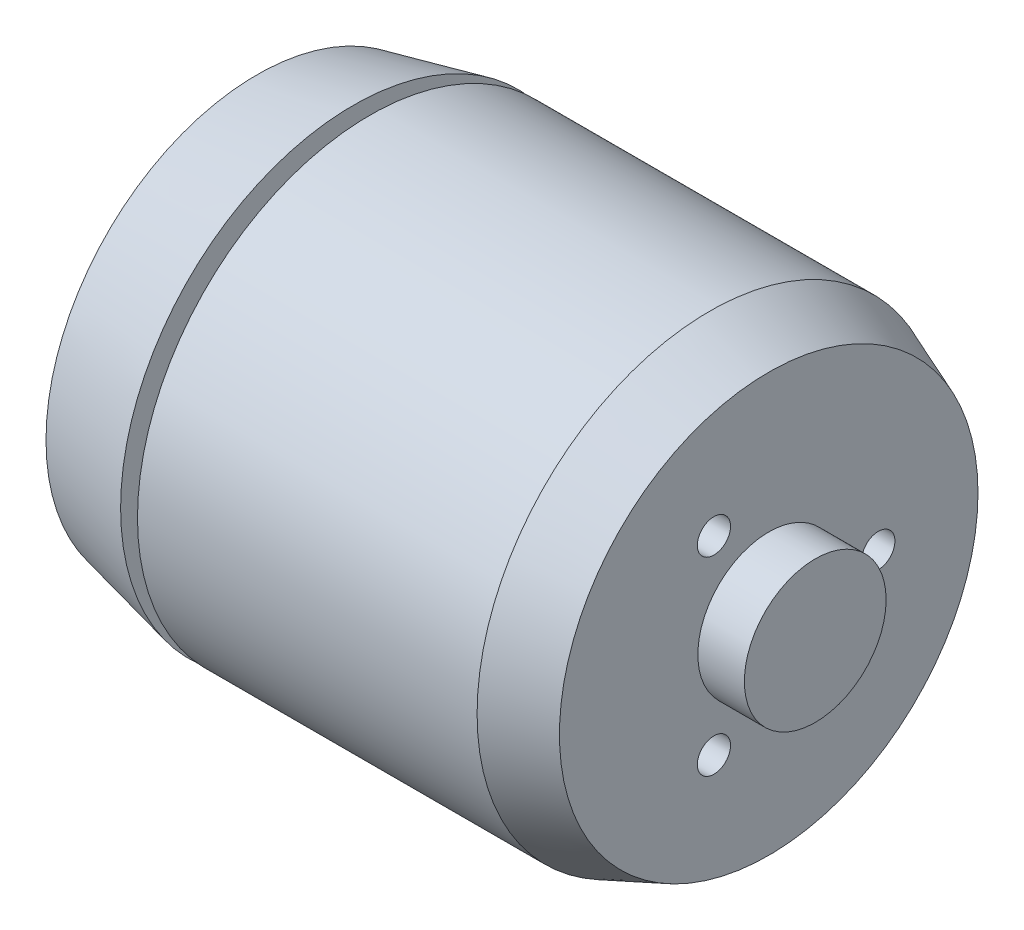
ISO-10303-21;
HEADER;
FILE_DESCRIPTION(('STEP AP214'),'2;1');
FILE_NAME('part.step','',(''),(''),'','','');
FILE_SCHEMA(('AUTOMOTIVE_DESIGN { 1 0 10303 214 1 1 1 1 }'));
ENDSEC;
DATA;
#1=APPLICATION_CONTEXT('core data for automotive mechanical design processes');
#2=APPLICATION_PROTOCOL_DEFINITION('international standard','automotive_design',2000,#1);
#3=PRODUCT_CONTEXT('',#1,'mechanical');
#4=PRODUCT('Part','Part','',(#3));
#5=PRODUCT_RELATED_PRODUCT_CATEGORY('part','',(#4));
#6=PRODUCT_DEFINITION_FORMATION('','',#4);
#7=PRODUCT_DEFINITION_CONTEXT('part definition',#1,'design');
#8=PRODUCT_DEFINITION('design','',#6,#7);
#9=PRODUCT_DEFINITION_SHAPE('','',#8);
#10=(LENGTH_UNIT() NAMED_UNIT(*) SI_UNIT(.MILLI.,.METRE.));
#11=(NAMED_UNIT(*) PLANE_ANGLE_UNIT() SI_UNIT($,.RADIAN.));
#12=(NAMED_UNIT(*) SI_UNIT($,.STERADIAN.) SOLID_ANGLE_UNIT());
#13=UNCERTAINTY_MEASURE_WITH_UNIT(LENGTH_MEASURE(1.E-05),#10,'distance_accuracy_value','');
#14=(GEOMETRIC_REPRESENTATION_CONTEXT(3) GLOBAL_UNCERTAINTY_ASSIGNED_CONTEXT((#13)) GLOBAL_UNIT_ASSIGNED_CONTEXT((#10,
#11,#12)) REPRESENTATION_CONTEXT('',''));
#15=CARTESIAN_POINT('',(0.,0.,0.));
#16=DIRECTION('',(0.,0.,1.));
#17=DIRECTION('',(1.,0.,0.));
#18=AXIS2_PLACEMENT_3D('',#15,#16,#17);
#19=CARTESIAN_POINT('',(-6.,0.,0.));
#20=DIRECTION('',(0.,0.,-1.));
#21=DIRECTION('',(0.,-1.,0.));
#22=AXIS2_PLACEMENT_3D('',#19,#20,#21);
#23=PLANE('',#22);
#24=DIRECTION('',(0.,1.,0.));
#25=VECTOR('',#24,1.);
#26=CARTESIAN_POINT('',(0.9854,-5.08,0.));
#27=LINE('',#26,#25);
#28=CARTESIAN_POINT('',(0.9854,-5.08,0.));
#29=VERTEX_POINT('',#28);
#30=CARTESIAN_POINT('',(0.9854,5.08,0.));
#31=VERTEX_POINT('',#30);
#32=EDGE_CURVE('E276',#29,#31,#27,.T.);
#33=ORIENTED_EDGE('',*,*,#32,.F.);
#34=DIRECTION('',(1.,0.,0.));
#35=VECTOR('',#34,1.);
#36=CARTESIAN_POINT('',(-3.7644,-5.08,0.));
#37=LINE('',#36,#35);
#38=CARTESIAN_POINT('',(-3.7644,-5.08,0.));
#39=VERTEX_POINT('',#38);
#40=EDGE_CURVE('E248',#39,#29,#37,.T.);
#41=ORIENTED_EDGE('',*,*,#40,.F.);
#42=DIRECTION('',(0.,-1.,0.));
#43=VECTOR('',#42,1.);
#44=CARTESIAN_POINT('',(-3.7644,-5.08,0.));
#45=LINE('',#44,#43);
#46=CARTESIAN_POINT('',(-3.7644,5.08,0.));
#47=VERTEX_POINT('',#46);
#48=EDGE_CURVE('E10',#47,#39,#45,.T.);
#49=ORIENTED_EDGE('',*,*,#48,.F.);
#50=DIRECTION('',(-1.,0.,0.));
#51=VECTOR('',#50,1.);
#52=CARTESIAN_POINT('',(-3.7644,5.08,0.));
#53=LINE('',#52,#51);
#54=EDGE_CURVE('E308',#31,#47,#53,.T.);
#55=ORIENTED_EDGE('',*,*,#54,.F.);
#56=EDGE_LOOP('',(#33,#41,#49,#55));
#57=FACE_BOUND('',#56,.T.);
#58=ADVANCED_FACE('F16',(#57),#23,.T.);
#59=CARTESIAN_POINT('',(-3.7644,-5.08,-17.5));
#60=DIRECTION('',(-1.,0.,0.));
#61=DIRECTION('',(0.,0.,1.));
#62=AXIS2_PLACEMENT_3D('',#59,#60,#61);
#63=PLANE('',#62);
#64=CARTESIAN_POINT('',(-3.7644,0.,-11.0612));
#65=DIRECTION('',(1.,0.,0.));
#66=DIRECTION('',(0.,0.,1.));
#67=AXIS2_PLACEMENT_3D('',#64,#65,#66);
#68=CIRCLE('',#67,4.);
#69=CARTESIAN_POINT('',(-3.7644,0.,-15.0612));
#70=VERTEX_POINT('',#69);
#71=EDGE_CURVE('E343',#70,#70,#68,.T.);
#72=ORIENTED_EDGE('',*,*,#71,.F.);
#73=EDGE_LOOP('',(#72));
#74=FACE_BOUND('',#73,.T.);
#75=DIRECTION('',(0.,0.,1.));
#76=VECTOR('',#75,1.);
#77=CARTESIAN_POINT('',(-3.7644,5.08,-17.5));
#78=LINE('',#77,#76);
#79=CARTESIAN_POINT('',(-3.7644,5.08,-15.3348552618978));
#80=VERTEX_POINT('',#79);
#81=EDGE_CURVE('E20',#80,#47,#78,.T.);
#82=ORIENTED_EDGE('',*,*,#81,.T.);
#83=ORIENTED_EDGE('',*,*,#48,.T.);
#84=DIRECTION('',(0.,0.,1.));
#85=VECTOR('',#84,1.);
#86=CARTESIAN_POINT('',(-3.7644,-5.08,-17.5));
#87=LINE('',#86,#85);
#88=CARTESIAN_POINT('',(-3.7644,-5.08,-15.3348552618978));
#89=VERTEX_POINT('',#88);
#90=EDGE_CURVE('E244',#89,#39,#87,.T.);
#91=ORIENTED_EDGE('',*,*,#90,.F.);
#92=CARTESIAN_POINT('',(-3.7644,0.,0.));
#93=DIRECTION('',(-1.,0.,0.));
#94=DIRECTION('',(0.,0.,1.));
#95=AXIS2_PLACEMENT_3D('',#92,#93,#94);
#96=CIRCLE('',#95,16.1543859649123);
#97=EDGE_CURVE('E294',#80,#89,#96,.T.);
#98=ORIENTED_EDGE('',*,*,#97,.F.);
#99=EDGE_LOOP('',(#82,#83,#91,#98));
#100=FACE_BOUND('',#99,.T.);
#101=ADVANCED_FACE('F604',(#74,#100),#63,.F.);
#102=CARTESIAN_POINT('',(-3.7644,5.08,-17.5));
#103=DIRECTION('',(0.,1.,0.));
#104=DIRECTION('',(1.,0.,0.));
#105=AXIS2_PLACEMENT_3D('',#102,#103,#104);
#106=PLANE('',#105);
#107=DIRECTION('',(0.,0.,1.));
#108=VECTOR('',#107,1.);
#109=CARTESIAN_POINT('',(0.9854,5.08,-17.5));
#110=LINE('',#109,#108);
#111=CARTESIAN_POINT('',(0.9854,5.08,-16.4542744521131));
#112=VERTEX_POINT('',#111);
#113=EDGE_CURVE('E249',#112,#31,#110,.T.);
#114=ORIENTED_EDGE('',*,*,#113,.T.);
#115=ORIENTED_EDGE('',*,*,#54,.T.);
#116=ORIENTED_EDGE('',*,*,#81,.F.);
#117=CARTESIAN_POINT('',(0.9854,5.08,-16.4542744521131));
#118=CARTESIAN_POINT('',(-0.598129142286878,5.08,-16.0822506345086));
#119=CARTESIAN_POINT('',(-2.18141487248692,5.08,-15.7091919528578));
#120=CARTESIAN_POINT('',(-3.7644,5.08,-15.3348552618978));
#121=(BOUNDED_CURVE() B_SPLINE_CURVE(3,(#117,#118,#119,#120),.UNSPECIFIED.,.F.,
.F.) B_SPLINE_CURVE_WITH_KNOTS((4,4),(0.0186183002080263,0.0234982279464003),
.UNSPECIFIED.) CURVE() GEOMETRIC_REPRESENTATION_ITEM() RATIONAL_B_SPLINE_CURVE((1.,1.,1.,1.)) REPRESENTATION_ITEM(''));
#122=EDGE_CURVE('E265',#112,#80,#121,.T.);
#123=ORIENTED_EDGE('',*,*,#122,.F.);
#124=EDGE_LOOP('',(#114,#115,#116,#123));
#125=FACE_BOUND('',#124,.T.);
#126=ADVANCED_FACE('F609',(#125),#106,.F.);
#127=CARTESIAN_POINT('',(-3.7644,-5.08,-17.5));
#128=DIRECTION('',(0.,-1.,0.));
#129=DIRECTION('',(0.,0.,-1.));
#130=AXIS2_PLACEMENT_3D('',#127,#128,#129);
#131=PLANE('',#130);
#132=ORIENTED_EDGE('',*,*,#90,.T.);
#133=ORIENTED_EDGE('',*,*,#40,.T.);
#134=DIRECTION('',(0.,0.,1.));
#135=VECTOR('',#134,1.);
#136=CARTESIAN_POINT('',(0.9854,-5.08,-17.5));
#137=LINE('',#136,#135);
#138=CARTESIAN_POINT('',(0.9854,-5.08,-16.4542744521131));
#139=VERTEX_POINT('',#138);
#140=EDGE_CURVE('E272',#139,#29,#137,.T.);
#141=ORIENTED_EDGE('',*,*,#140,.F.);
#142=CARTESIAN_POINT('',(-3.7644,-5.08,-15.3348552618978));
#143=CARTESIAN_POINT('',(-2.18141642114675,-5.08,-15.7091915866381));
#144=CARTESIAN_POINT('',(-0.59812759620077,-5.08,-16.0822509977358));
#145=CARTESIAN_POINT('',(0.9854,-5.08,-16.4542744521131));
#146=(BOUNDED_CURVE() B_SPLINE_CURVE(3,(#142,#143,#144,#145),.UNSPECIFIED.,.F.,
.F.) B_SPLINE_CURVE_WITH_KNOTS((4,4),(0.0186526350852368,0.0235325216490011),
.UNSPECIFIED.) CURVE() GEOMETRIC_REPRESENTATION_ITEM() RATIONAL_B_SPLINE_CURVE((1.,1.,1.,1.)) REPRESENTATION_ITEM(''));
#147=EDGE_CURVE('E266',#89,#139,#146,.T.);
#148=ORIENTED_EDGE('',*,*,#147,.F.);
#149=EDGE_LOOP('',(#132,#133,#141,#148));
#150=FACE_BOUND('',#149,.T.);
#151=ADVANCED_FACE('F666',(#150),#131,.F.);
#152=CARTESIAN_POINT('',(0.9854,-5.08,-17.5));
#153=DIRECTION('',(1.,0.,0.));
#154=DIRECTION('',(0.,0.,1.));
#155=AXIS2_PLACEMENT_3D('',#152,#153,#154);
#156=PLANE('',#155);
#157=ORIENTED_EDGE('',*,*,#140,.T.);
#158=ORIENTED_EDGE('',*,*,#32,.T.);
#159=ORIENTED_EDGE('',*,*,#113,.F.);
#160=CARTESIAN_POINT('',(0.9854,0.,0.));
#161=DIRECTION('',(1.,0.,0.));
#162=DIRECTION('',(0.,0.,-1.));
#163=AXIS2_PLACEMENT_3D('',#160,#161,#162);
#164=CIRCLE('',#163,17.2206140350877);
#165=EDGE_CURVE('E261',#139,#112,#164,.T.);
#166=ORIENTED_EDGE('',*,*,#165,.F.);
#167=EDGE_LOOP('',(#157,#158,#159,#166));
#168=FACE_BOUND('',#167,.T.);
#169=ADVANCED_FACE('F671',(#168),#156,.F.);
#170=CARTESIAN_POINT('',(-0.564000000000009,-11.0612,0.));
#171=DIRECTION('',(-1.,0.,0.));
#172=DIRECTION('',(0.,0.,1.));
#173=AXIS2_PLACEMENT_3D('',#170,#171,#172);
#174=PLANE('',#173);
#175=CARTESIAN_POINT('',(-0.564000000000009,-11.0612,0.));
#176=DIRECTION('',(-1.,0.,0.));
#177=DIRECTION('',(0.,0.,1.));
#178=AXIS2_PLACEMENT_3D('',#175,#176,#177);
#179=CIRCLE('',#178,4.);
#180=CARTESIAN_POINT('',(-0.564000000000008,-11.0612,-4.));
#181=VERTEX_POINT('',#180);
#182=EDGE_CURVE('E236',#181,#181,#179,.T.);
#183=ORIENTED_EDGE('',*,*,#182,.T.);
#184=EDGE_LOOP('',(#183));
#185=FACE_BOUND('',#184,.T.);
#186=ADVANCED_FACE('F535',(#185),#174,.T.);
#187=CARTESIAN_POINT('',(-0.564000000000007,-6.71751442127222,-6.71751442127219));
#188=DIRECTION('',(-1.,0.,0.));
#189=DIRECTION('',(0.,0.,1.));
#190=AXIS2_PLACEMENT_3D('',#187,#188,#189);
#191=PLANE('',#190);
#192=CARTESIAN_POINT('',(-0.564000000000007,-6.71751442127222,-6.71751442127219));
#193=DIRECTION('',(-1.,0.,0.));
#194=DIRECTION('',(0.,0.,1.));
#195=AXIS2_PLACEMENT_3D('',#192,#193,#194);
#196=CIRCLE('',#195,1.5);
#197=CARTESIAN_POINT('',(-0.564,-6.71751442127222,-8.21751442127219));
#198=VERTEX_POINT('',#197);
#199=EDGE_CURVE('E280',#198,#198,#196,.T.);
#200=ORIENTED_EDGE('',*,*,#199,.T.);
#201=EDGE_LOOP('',(#200));
#202=FACE_BOUND('',#201,.T.);
#203=ADVANCED_FACE('F529',(#202),#191,.T.);
#204=CARTESIAN_POINT('',(-0.564000000000007,8.83883476483182,-8.83883476483186));
#205=DIRECTION('',(-1.,0.,0.));
#206=DIRECTION('',(0.,0.,1.));
#207=AXIS2_PLACEMENT_3D('',#204,#205,#206);
#208=PLANE('',#207);
#209=CARTESIAN_POINT('',(-0.564000000000007,8.83883476483182,-8.83883476483186));
#210=DIRECTION('',(-1.,0.,0.));
#211=DIRECTION('',(0.,0.,1.));
#212=AXIS2_PLACEMENT_3D('',#209,#210,#211);
#213=CIRCLE('',#212,1.5);
#214=CARTESIAN_POINT('',(-0.564,8.83883476483182,-10.3388347648319));
#215=VERTEX_POINT('',#214);
#216=EDGE_CURVE('E301',#215,#215,#213,.T.);
#217=ORIENTED_EDGE('',*,*,#216,.T.);
#218=EDGE_LOOP('',(#217));
#219=FACE_BOUND('',#218,.T.);
#220=ADVANCED_FACE('F534',(#219),#208,.T.);
#221=CARTESIAN_POINT('',(-0.564000000000011,-8.83883476483183,8.83883476483186));
#222=DIRECTION('',(-1.,0.,0.));
#223=DIRECTION('',(0.,0.,1.));
#224=AXIS2_PLACEMENT_3D('',#221,#222,#223);
#225=PLANE('',#224);
#226=CARTESIAN_POINT('',(-0.564000000000011,-8.83883476483183,8.83883476483186));
#227=DIRECTION('',(-1.,0.,0.));
#228=DIRECTION('',(0.,0.,1.));
#229=AXIS2_PLACEMENT_3D('',#226,#227,#228);
#230=CIRCLE('',#229,1.5);
#231=CARTESIAN_POINT('',(-0.564000000000011,-8.83883476483183,7.33883476483186));
#232=VERTEX_POINT('',#231);
#233=EDGE_CURVE('E322',#232,#232,#230,.T.);
#234=ORIENTED_EDGE('',*,*,#233,.T.);
#235=EDGE_LOOP('',(#234));
#236=FACE_BOUND('',#235,.T.);
#237=ADVANCED_FACE('F433',(#236),#225,.T.);
#238=CARTESIAN_POINT('',(-0.564000000000009,11.0612,0.));
#239=DIRECTION('',(-1.,0.,0.));
#240=DIRECTION('',(0.,0.,1.));
#241=AXIS2_PLACEMENT_3D('',#238,#239,#240);
#242=PLANE('',#241);
#243=CARTESIAN_POINT('',(-0.564000000000009,11.0612,0.));
#244=DIRECTION('',(-1.,0.,0.));
#245=DIRECTION('',(0.,0.,1.));
#246=AXIS2_PLACEMENT_3D('',#243,#244,#245);
#247=CIRCLE('',#246,4.);
#248=CARTESIAN_POINT('',(-0.564000000000008,11.0612,-4.));
#249=VERTEX_POINT('',#248);
#250=EDGE_CURVE('E222',#249,#249,#247,.T.);
#251=ORIENTED_EDGE('',*,*,#250,.T.);
#252=EDGE_LOOP('',(#251));
#253=FACE_BOUND('',#252,.T.);
#254=ADVANCED_FACE('F597',(#253),#242,.T.);
#255=CARTESIAN_POINT('',(-0.564000000000013,0.,11.0612));
#256=DIRECTION('',(-1.,0.,0.));
#257=DIRECTION('',(0.,0.,1.));
#258=AXIS2_PLACEMENT_3D('',#255,#256,#257);
#259=PLANE('',#258);
#260=CARTESIAN_POINT('',(-0.564000000000013,0.,11.0612));
#261=DIRECTION('',(-1.,0.,0.));
#262=DIRECTION('',(0.,0.,1.));
#263=AXIS2_PLACEMENT_3D('',#260,#261,#262);
#264=CIRCLE('',#263,4.);
#265=CARTESIAN_POINT('',(-0.564000000000012,0.,7.0612));
#266=VERTEX_POINT('',#265);
#267=EDGE_CURVE('E202',#266,#266,#264,.T.);
#268=ORIENTED_EDGE('',*,*,#267,.T.);
#269=EDGE_LOOP('',(#268));
#270=FACE_BOUND('',#269,.T.);
#271=ADVANCED_FACE('F208',(#270),#259,.T.);
#272=CARTESIAN_POINT('',(-0.564000000000011,6.71751442127222,6.71751442127219));
#273=DIRECTION('',(-1.,0.,0.));
#274=DIRECTION('',(0.,0.,1.));
#275=AXIS2_PLACEMENT_3D('',#272,#273,#274);
#276=PLANE('',#275);
#277=CARTESIAN_POINT('',(-0.564000000000011,6.71751442127222,6.71751442127219));
#278=DIRECTION('',(-1.,0.,0.));
#279=DIRECTION('',(0.,0.,1.));
#280=AXIS2_PLACEMENT_3D('',#277,#278,#279);
#281=CIRCLE('',#280,1.5);
#282=CARTESIAN_POINT('',(-0.564000000000011,6.71751442127222,5.21751442127219));
#283=VERTEX_POINT('',#282);
#284=EDGE_CURVE('E312',#283,#283,#281,.T.);
#285=ORIENTED_EDGE('',*,*,#284,.T.);
#286=EDGE_LOOP('',(#285));
#287=FACE_BOUND('',#286,.T.);
#288=ADVANCED_FACE('F507',(#287),#276,.T.);
#289=CARTESIAN_POINT('',(2.23,0.,-12.5));
#290=DIRECTION('',(-1.,0.,0.));
#291=DIRECTION('',(0.,0.,1.));
#292=AXIS2_PLACEMENT_3D('',#289,#290,#291);
#293=PLANE('',#292);
#294=CARTESIAN_POINT('',(2.23,0.,0.));
#295=DIRECTION('',(-1.,0.,0.));
#296=DIRECTION('',(0.,0.,1.));
#297=AXIS2_PLACEMENT_3D('',#294,#295,#296);
#298=CIRCLE('',#297,12.5);
#299=CARTESIAN_POINT('',(2.23,0.,-12.5));
#300=VERTEX_POINT('',#299);
#301=EDGE_CURVE('E270',#300,#300,#298,.T.);
#302=ORIENTED_EDGE('',*,*,#301,.T.);
#303=EDGE_LOOP('',(#302));
#304=FACE_BOUND('',#303,.T.);
#305=CARTESIAN_POINT('',(2.23,0.,0.));
#306=DIRECTION('',(-1.,0.,0.));
#307=DIRECTION('',(0.,0.,1.));
#308=AXIS2_PLACEMENT_3D('',#305,#306,#307);
#309=CIRCLE('',#308,17.5);
#310=CARTESIAN_POINT('',(2.23,0.,17.5));
#311=VERTEX_POINT('',#310);
#312=EDGE_CURVE('E305',#311,#311,#309,.T.);
#313=ORIENTED_EDGE('',*,*,#312,.F.);
#314=EDGE_LOOP('',(#313));
#315=FACE_BOUND('',#314,.T.);
#316=ADVANCED_FACE('F501',(#304,#315),#293,.F.);
#317=CARTESIAN_POINT('',(-5.009,0.,-15.875));
#318=DIRECTION('',(1.,0.,0.));
#319=DIRECTION('',(0.,0.,1.));
#320=AXIS2_PLACEMENT_3D('',#317,#318,#319);
#321=PLANE('',#320);
#322=CARTESIAN_POINT('',(-5.009,0.,0.));
#323=DIRECTION('',(-1.,0.,0.));
#324=DIRECTION('',(0.,0.,1.));
#325=AXIS2_PLACEMENT_3D('',#322,#323,#324);
#326=CIRCLE('',#325,2.5);
#327=CARTESIAN_POINT('',(-5.009,0.,-2.5));
#328=VERTEX_POINT('',#327);
#329=EDGE_CURVE('E242',#328,#328,#326,.T.);
#330=ORIENTED_EDGE('',*,*,#329,.F.);
#331=EDGE_LOOP('',(#330));
#332=FACE_BOUND('',#331,.T.);
#333=CARTESIAN_POINT('',(-5.009,6.71751442127222,6.71751442127219));
#334=DIRECTION('',(-1.,0.,0.));
#335=DIRECTION('',(0.,0.,1.));
#336=AXIS2_PLACEMENT_3D('',#333,#334,#335);
#337=CIRCLE('',#336,1.5);
#338=CARTESIAN_POINT('',(-5.009,6.71751442127222,5.21751442127219));
#339=VERTEX_POINT('',#338);
#340=EDGE_CURVE('E267',#339,#339,#337,.T.);
#341=ORIENTED_EDGE('',*,*,#340,.F.);
#342=EDGE_LOOP('',(#341));
#343=FACE_BOUND('',#342,.T.);
#344=CARTESIAN_POINT('',(-5.009,0.,11.0612));
#345=DIRECTION('',(-1.,0.,0.));
#346=DIRECTION('',(0.,0.,1.));
#347=AXIS2_PLACEMENT_3D('',#344,#345,#346);
#348=CIRCLE('',#347,4.);
#349=CARTESIAN_POINT('',(-5.009,0.,7.0612));
#350=VERTEX_POINT('',#349);
#351=EDGE_CURVE('E204',#350,#350,#348,.T.);
#352=ORIENTED_EDGE('',*,*,#351,.F.);
#353=EDGE_LOOP('',(#352));
#354=FACE_BOUND('',#353,.T.);
#355=CARTESIAN_POINT('',(-5.009,11.0612,0.));
#356=DIRECTION('',(-1.,0.,0.));
#357=DIRECTION('',(0.,0.,1.));
#358=AXIS2_PLACEMENT_3D('',#355,#356,#357);
#359=CIRCLE('',#358,4.);
#360=CARTESIAN_POINT('',(-5.009,11.0612,-4.));
#361=VERTEX_POINT('',#360);
#362=EDGE_CURVE('E210',#361,#361,#359,.T.);
#363=ORIENTED_EDGE('',*,*,#362,.F.);
#364=EDGE_LOOP('',(#363));
#365=FACE_BOUND('',#364,.T.);
#366=CARTESIAN_POINT('',(-5.009,0.,-11.0612));
#367=DIRECTION('',(-1.,0.,0.));
#368=DIRECTION('',(0.,0.,1.));
#369=AXIS2_PLACEMENT_3D('',#366,#367,#368);
#370=CIRCLE('',#369,4.);
#371=CARTESIAN_POINT('',(-5.009,0.,-15.0612));
#372=VERTEX_POINT('',#371);
#373=EDGE_CURVE('E226',#372,#372,#370,.T.);
#374=ORIENTED_EDGE('',*,*,#373,.F.);
#375=EDGE_LOOP('',(#374));
#376=FACE_BOUND('',#375,.T.);
#377=CARTESIAN_POINT('',(-5.009,-8.83883476483183,8.83883476483186));
#378=DIRECTION('',(-1.,0.,0.));
#379=DIRECTION('',(0.,0.,1.));
#380=AXIS2_PLACEMENT_3D('',#377,#378,#379);
#381=CIRCLE('',#380,1.5);
#382=CARTESIAN_POINT('',(-5.009,-8.83883476483183,7.33883476483186));
#383=VERTEX_POINT('',#382);
#384=EDGE_CURVE('E220',#383,#383,#381,.T.);
#385=ORIENTED_EDGE('',*,*,#384,.F.);
#386=EDGE_LOOP('',(#385));
#387=FACE_BOUND('',#386,.T.);
#388=CARTESIAN_POINT('',(-5.009,8.83883476483182,-8.83883476483186));
#389=DIRECTION('',(-1.,0.,0.));
#390=DIRECTION('',(0.,0.,1.));
#391=AXIS2_PLACEMENT_3D('',#388,#389,#390);
#392=CIRCLE('',#391,1.5);
#393=CARTESIAN_POINT('',(-5.009,8.83883476483182,-10.3388347648319));
#394=VERTEX_POINT('',#393);
#395=EDGE_CURVE('E74',#394,#394,#392,.T.);
#396=ORIENTED_EDGE('',*,*,#395,.F.);
#397=EDGE_LOOP('',(#396));
#398=FACE_BOUND('',#397,.T.);
#399=CARTESIAN_POINT('',(-5.009,-6.71751442127222,-6.71751442127219));
#400=DIRECTION('',(-1.,0.,0.));
#401=DIRECTION('',(0.,0.,1.));
#402=AXIS2_PLACEMENT_3D('',#399,#400,#401);
#403=CIRCLE('',#402,1.5);
#404=CARTESIAN_POINT('',(-5.009,-6.71751442127222,-8.21751442127219));
#405=VERTEX_POINT('',#404);
#406=EDGE_CURVE('E295',#405,#405,#403,.T.);
#407=ORIENTED_EDGE('',*,*,#406,.F.);
#408=EDGE_LOOP('',(#407));
#409=FACE_BOUND('',#408,.T.);
#410=CARTESIAN_POINT('',(-5.009,-11.0612,0.));
#411=DIRECTION('',(-1.,0.,0.));
#412=DIRECTION('',(0.,0.,1.));
#413=AXIS2_PLACEMENT_3D('',#410,#411,#412);
#414=CIRCLE('',#413,4.);
#415=CARTESIAN_POINT('',(-5.009,-11.0612,-4.));
#416=VERTEX_POINT('',#415);
#417=EDGE_CURVE('E277',#416,#416,#414,.T.);
#418=ORIENTED_EDGE('',*,*,#417,.F.);
#419=EDGE_LOOP('',(#418));
#420=FACE_BOUND('',#419,.T.);
#421=CARTESIAN_POINT('',(-5.009,0.,0.));
#422=DIRECTION('',(-1.,0.,0.));
#423=DIRECTION('',(0.,0.,1.));
#424=AXIS2_PLACEMENT_3D('',#421,#422,#423);
#425=CIRCLE('',#424,15.875);
#426=CARTESIAN_POINT('',(-5.009,0.,15.875));
#427=VERTEX_POINT('',#426);
#428=EDGE_CURVE('E117',#427,#427,#425,.T.);
#429=ORIENTED_EDGE('',*,*,#428,.T.);
#430=EDGE_LOOP('',(#429));
#431=FACE_BOUND('',#430,.T.);
#432=ADVANCED_FACE('F506',(#332,#343,#354,#365,#376,#387,#398,#409,#420,#431),#321,.F.);
#433=CARTESIAN_POINT('',(-6.,0.,-2.5));
#434=DIRECTION('',(1.,0.,0.));
#435=DIRECTION('',(0.,0.,1.));
#436=AXIS2_PLACEMENT_3D('',#433,#434,#435);
#437=PLANE('',#436);
#438=CARTESIAN_POINT('',(-6.,0.,0.));
#439=DIRECTION('',(-1.,0.,0.));
#440=DIRECTION('',(0.,0.,1.));
#441=AXIS2_PLACEMENT_3D('',#438,#439,#440);
#442=CIRCLE('',#441,2.5);
#443=CARTESIAN_POINT('',(-6.,0.,-2.5));
#444=VERTEX_POINT('',#443);
#445=EDGE_CURVE('E243',#444,#444,#442,.T.);
#446=ORIENTED_EDGE('',*,*,#445,.T.);
#447=EDGE_LOOP('',(#446));
#448=FACE_BOUND('',#447,.T.);
#449=ADVANCED_FACE('F691',(#448),#437,.F.);
#450=CARTESIAN_POINT('',(-293.397520162874,0.,0.));
#451=DIRECTION('',(-1.,0.,0.));
#452=DIRECTION('',(0.,0.,1.));
#453=AXIS2_PLACEMENT_3D('',#450,#451,#452);
#454=CYLINDRICAL_SURFACE('',#453,2.5);
#455=ORIENTED_EDGE('',*,*,#445,.F.);
#456=DIRECTION('',(1.,0.,0.));
#457=VECTOR('',#456,1.);
#458=CARTESIAN_POINT('',(-293.397520162874,0.,-2.50000000000008));
#459=LINE('',#458,#457);
#460=EDGE_CURVE('E238',#444,#328,#459,.T.);
#461=ORIENTED_EDGE('',*,*,#460,.T.);
#462=ORIENTED_EDGE('',*,*,#329,.T.);
#463=ORIENTED_EDGE('',*,*,#460,.F.);
#464=EDGE_LOOP('',(#455,#461,#462,#463));
#465=FACE_BOUND('',#464,.T.);
#466=ADVANCED_FACE('F702',(#465),#454,.T.);
#467=CARTESIAN_POINT('',(2.23,0.,0.));
#468=DIRECTION('',(1.,0.,0.));
#469=DIRECTION('',(0.,0.,-1.));
#470=AXIS2_PLACEMENT_3D('',#467,#468,#469);
#471=CONICAL_SURFACE('',#470,17.5,0.220818033952911);
#472=ORIENTED_EDGE('',*,*,#97,.T.);
#473=ORIENTED_EDGE('',*,*,#147,.T.);
#474=ORIENTED_EDGE('',*,*,#165,.T.);
#475=ORIENTED_EDGE('',*,*,#122,.T.);
#476=EDGE_LOOP('',(#472,#473,#474,#475));
#477=FACE_BOUND('',#476,.T.);
#478=ORIENTED_EDGE('',*,*,#312,.T.);
#479=DIRECTION('',(-0.975718603584016,0.,-0.219027867222549));
#480=VECTOR('',#479,1.);
#481=CARTESIAN_POINT('',(2.23,0.,17.5));
#482=LINE('',#481,#480);
#483=EDGE_CURVE('E132',#311,#427,#482,.T.);
#484=ORIENTED_EDGE('',*,*,#483,.T.);
#485=ORIENTED_EDGE('',*,*,#428,.F.);
#486=ORIENTED_EDGE('',*,*,#483,.F.);
#487=EDGE_LOOP('',(#478,#484,#485,#486));
#488=FACE_BOUND('',#487,.T.);
#489=ADVANCED_FACE('F584',(#477,#488),#471,.T.);
#490=CARTESIAN_POINT('',(-293.397520162874,0.,0.));
#491=DIRECTION('',(-1.,0.,0.));
#492=DIRECTION('',(0.,0.,1.));
#493=AXIS2_PLACEMENT_3D('',#490,#491,#492);
#494=CYLINDRICAL_SURFACE('',#493,12.5);
#495=ORIENTED_EDGE('',*,*,#301,.F.);
#496=DIRECTION('',(1.,0.,0.));
#497=VECTOR('',#496,1.);
#498=CARTESIAN_POINT('',(-293.397520162874,0.,-12.5));
#499=LINE('',#498,#497);
#500=CARTESIAN_POINT('',(3.5,0.,-12.5));
#501=VERTEX_POINT('',#500);
#502=EDGE_CURVE('E288',#300,#501,#499,.T.);
#503=ORIENTED_EDGE('',*,*,#502,.T.);
#504=CARTESIAN_POINT('',(3.5,0.,0.));
#505=DIRECTION('',(-1.,0.,0.));
#506=DIRECTION('',(0.,0.,1.));
#507=AXIS2_PLACEMENT_3D('',#504,#505,#506);
#508=CIRCLE('',#507,12.5);
#509=EDGE_CURVE('E250',#501,#501,#508,.T.);
#510=ORIENTED_EDGE('',*,*,#509,.T.);
#511=ORIENTED_EDGE('',*,*,#502,.F.);
#512=EDGE_LOOP('',(#495,#503,#510,#511));
#513=FACE_BOUND('',#512,.T.);
#514=ADVANCED_FACE('F578',(#513),#494,.T.);
#515=CARTESIAN_POINT('',(-0.564000000000011,6.71751442127222,6.71751442127219));
#516=DIRECTION('',(-1.,0.,0.));
#517=DIRECTION('',(0.,0.,1.));
#518=AXIS2_PLACEMENT_3D('',#515,#516,#517);
#519=CYLINDRICAL_SURFACE('',#518,1.5);
#520=ORIENTED_EDGE('',*,*,#284,.F.);
#521=DIRECTION('',(-1.,0.,0.));
#522=VECTOR('',#521,1.);
#523=CARTESIAN_POINT('',(-0.564000000000011,6.71751442127222,5.21751442127219));
#524=LINE('',#523,#522);
#525=EDGE_CURVE('E271',#283,#339,#524,.T.);
#526=ORIENTED_EDGE('',*,*,#525,.T.);
#527=ORIENTED_EDGE('',*,*,#340,.T.);
#528=ORIENTED_EDGE('',*,*,#525,.F.);
#529=EDGE_LOOP('',(#520,#526,#527,#528));
#530=FACE_BOUND('',#529,.T.);
#531=ADVANCED_FACE('F583',(#530),#519,.F.);
#532=CARTESIAN_POINT('',(-0.564000000000013,0.,11.0612));
#533=DIRECTION('',(-1.,0.,0.));
#534=DIRECTION('',(0.,0.,1.));
#535=AXIS2_PLACEMENT_3D('',#532,#533,#534);
#536=CYLINDRICAL_SURFACE('',#535,4.);
#537=ORIENTED_EDGE('',*,*,#267,.F.);
#538=DIRECTION('',(-1.,0.,0.));
#539=VECTOR('',#538,1.);
#540=CARTESIAN_POINT('',(-0.564000000000012,0.,7.0612));
#541=LINE('',#540,#539);
#542=EDGE_CURVE('E200',#266,#350,#541,.T.);
#543=ORIENTED_EDGE('',*,*,#542,.T.);
#544=ORIENTED_EDGE('',*,*,#351,.T.);
#545=ORIENTED_EDGE('',*,*,#542,.F.);
#546=EDGE_LOOP('',(#537,#543,#544,#545));
#547=FACE_BOUND('',#546,.T.);
#548=ADVANCED_FACE('F18',(#547),#536,.F.);
#549=CARTESIAN_POINT('',(-0.564000000000009,11.0612,0.));
#550=DIRECTION('',(-1.,0.,0.));
#551=DIRECTION('',(0.,0.,1.));
#552=AXIS2_PLACEMENT_3D('',#549,#550,#551);
#553=CYLINDRICAL_SURFACE('',#552,4.);
#554=ORIENTED_EDGE('',*,*,#250,.F.);
#555=DIRECTION('',(-1.,0.,0.));
#556=VECTOR('',#555,1.);
#557=CARTESIAN_POINT('',(-0.564000000000008,11.0612,-4.));
#558=LINE('',#557,#556);
#559=EDGE_CURVE('E216',#249,#361,#558,.T.);
#560=ORIENTED_EDGE('',*,*,#559,.T.);
#561=ORIENTED_EDGE('',*,*,#362,.T.);
#562=ORIENTED_EDGE('',*,*,#559,.F.);
#563=EDGE_LOOP('',(#554,#560,#561,#562));
#564=FACE_BOUND('',#563,.T.);
#565=ADVANCED_FACE('F470',(#564),#553,.F.);
#566=CARTESIAN_POINT('',(-0.564,0.,-11.0612));
#567=DIRECTION('',(-1.,0.,0.));
#568=DIRECTION('',(0.,0.,1.));
#569=AXIS2_PLACEMENT_3D('',#566,#567,#568);
#570=CYLINDRICAL_SURFACE('',#569,4.);
#571=ORIENTED_EDGE('',*,*,#71,.T.);
#572=DIRECTION('',(-1.,0.,0.));
#573=VECTOR('',#572,1.);
#574=CARTESIAN_POINT('',(-0.564,0.,-15.0612));
#575=LINE('',#574,#573);
#576=EDGE_CURVE('E347',#70,#372,#575,.T.);
#577=ORIENTED_EDGE('',*,*,#576,.T.);
#578=ORIENTED_EDGE('',*,*,#373,.T.);
#579=ORIENTED_EDGE('',*,*,#576,.F.);
#580=EDGE_LOOP('',(#571,#577,#578,#579));
#581=FACE_BOUND('',#580,.T.);
#582=ADVANCED_FACE('F476',(#581),#570,.F.);
#583=CARTESIAN_POINT('',(-0.564000000000011,-8.83883476483183,8.83883476483186));
#584=DIRECTION('',(-1.,0.,0.));
#585=DIRECTION('',(0.,0.,1.));
#586=AXIS2_PLACEMENT_3D('',#583,#584,#585);
#587=CYLINDRICAL_SURFACE('',#586,1.5);
#588=ORIENTED_EDGE('',*,*,#233,.F.);
#589=DIRECTION('',(-1.,0.,0.));
#590=VECTOR('',#589,1.);
#591=CARTESIAN_POINT('',(-0.564000000000011,-8.83883476483183,7.33883476483186));
#592=LINE('',#591,#590);
#593=EDGE_CURVE('E358',#232,#383,#592,.T.);
#594=ORIENTED_EDGE('',*,*,#593,.T.);
#595=ORIENTED_EDGE('',*,*,#384,.T.);
#596=ORIENTED_EDGE('',*,*,#593,.F.);
#597=EDGE_LOOP('',(#588,#594,#595,#596));
#598=FACE_BOUND('',#597,.T.);
#599=ADVANCED_FACE('F435',(#598),#587,.F.);
#600=CARTESIAN_POINT('',(-0.564000000000007,8.83883476483182,-8.83883476483186));
#601=DIRECTION('',(-1.,0.,0.));
#602=DIRECTION('',(0.,0.,1.));
#603=AXIS2_PLACEMENT_3D('',#600,#601,#602);
#604=CYLINDRICAL_SURFACE('',#603,1.5);
#605=ORIENTED_EDGE('',*,*,#216,.F.);
#606=DIRECTION('',(-1.,0.,0.));
#607=VECTOR('',#606,1.);
#608=CARTESIAN_POINT('',(-0.564,8.83883476483182,-10.3388347648319));
#609=LINE('',#608,#607);
#610=EDGE_CURVE('E84',#215,#394,#609,.T.);
#611=ORIENTED_EDGE('',*,*,#610,.T.);
#612=ORIENTED_EDGE('',*,*,#395,.T.);
#613=ORIENTED_EDGE('',*,*,#610,.F.);
#614=EDGE_LOOP('',(#605,#611,#612,#613));
#615=FACE_BOUND('',#614,.T.);
#616=ADVANCED_FACE('F632',(#615),#604,.F.);
#617=CARTESIAN_POINT('',(-0.564000000000007,-6.71751442127222,-6.71751442127219));
#618=DIRECTION('',(-1.,0.,0.));
#619=DIRECTION('',(0.,0.,1.));
#620=AXIS2_PLACEMENT_3D('',#617,#618,#619);
#621=CYLINDRICAL_SURFACE('',#620,1.5);
#622=ORIENTED_EDGE('',*,*,#199,.F.);
#623=DIRECTION('',(-1.,0.,0.));
#624=VECTOR('',#623,1.);
#625=CARTESIAN_POINT('',(-0.564,-6.71751442127222,-8.21751442127219));
#626=LINE('',#625,#624);
#627=EDGE_CURVE('E302',#198,#405,#626,.T.);
#628=ORIENTED_EDGE('',*,*,#627,.T.);
#629=ORIENTED_EDGE('',*,*,#406,.T.);
#630=ORIENTED_EDGE('',*,*,#627,.F.);
#631=EDGE_LOOP('',(#622,#628,#629,#630));
#632=FACE_BOUND('',#631,.T.);
#633=ADVANCED_FACE('F626',(#632),#621,.F.);
#634=CARTESIAN_POINT('',(-0.564000000000009,-11.0612,0.));
#635=DIRECTION('',(-1.,0.,0.));
#636=DIRECTION('',(0.,0.,1.));
#637=AXIS2_PLACEMENT_3D('',#634,#635,#636);
#638=CYLINDRICAL_SURFACE('',#637,4.);
#639=ORIENTED_EDGE('',*,*,#182,.F.);
#640=DIRECTION('',(-1.,0.,0.));
#641=VECTOR('',#640,1.);
#642=CARTESIAN_POINT('',(-0.564000000000008,-11.0612,-4.));
#643=LINE('',#642,#641);
#644=EDGE_CURVE('E281',#181,#416,#643,.T.);
#645=ORIENTED_EDGE('',*,*,#644,.T.);
#646=ORIENTED_EDGE('',*,*,#417,.T.);
#647=ORIENTED_EDGE('',*,*,#644,.F.);
#648=EDGE_LOOP('',(#639,#645,#646,#647));
#649=FACE_BOUND('',#648,.T.);
#650=ADVANCED_FACE('F631',(#649),#638,.F.);
#651=CARTESIAN_POINT('',(28.5,7.1428,4.12389750276767));
#652=DIRECTION('',(1.,0.,0.));
#653=DIRECTION('',(0.,1.,0.));
#654=AXIS2_PLACEMENT_3D('',#651,#652,#653);
#655=PLANE('',#654);
#656=CARTESIAN_POINT('',(28.5,7.1428,4.12389750276767));
#657=DIRECTION('',(1.,0.,0.));
#658=DIRECTION('',(0.,0.,-1.));
#659=AXIS2_PLACEMENT_3D('',#656,#657,#658);
#660=CIRCLE('',#659,1.25);
#661=CARTESIAN_POINT('',(28.5,7.1428,5.37389750276767));
#662=VERTEX_POINT('',#661);
#663=EDGE_CURVE('E254',#662,#662,#660,.T.);
#664=ORIENTED_EDGE('',*,*,#663,.T.);
#665=EDGE_LOOP('',(#664));
#666=FACE_BOUND('',#665,.T.);
#667=ADVANCED_FACE('F773',(#666),#655,.T.);
#668=CARTESIAN_POINT('',(28.5,-7.1428,4.12389750276767));
#669=DIRECTION('',(1.,0.,0.));
#670=DIRECTION('',(0.,1.,0.));
#671=AXIS2_PLACEMENT_3D('',#668,#669,#670);
#672=PLANE('',#671);
#673=CARTESIAN_POINT('',(28.5,-7.1428,4.12389750276767));
#674=DIRECTION('',(1.,0.,0.));
#675=DIRECTION('',(0.,0.,-1.));
#676=AXIS2_PLACEMENT_3D('',#673,#674,#675);
#677=CIRCLE('',#676,1.25);
#678=CARTESIAN_POINT('',(28.5,-7.1428,5.37389750276767));
#679=VERTEX_POINT('',#678);
#680=EDGE_CURVE('E372',#679,#679,#677,.T.);
#681=ORIENTED_EDGE('',*,*,#680,.T.);
#682=EDGE_LOOP('',(#681));
#683=FACE_BOUND('',#682,.T.);
#684=ADVANCED_FACE('F768',(#683),#672,.T.);
#685=CARTESIAN_POINT('',(28.5,0.,-8.24779500553533));
#686=DIRECTION('',(1.,0.,0.));
#687=DIRECTION('',(0.,1.,0.));
#688=AXIS2_PLACEMENT_3D('',#685,#686,#687);
#689=PLANE('',#688);
#690=CARTESIAN_POINT('',(28.5,0.,-8.24779500553533));
#691=DIRECTION('',(1.,0.,0.));
#692=DIRECTION('',(0.,0.,-1.));
#693=AXIS2_PLACEMENT_3D('',#690,#691,#692);
#694=CIRCLE('',#693,1.25);
#695=CARTESIAN_POINT('',(28.5,0.,-6.99779500553533));
#696=VERTEX_POINT('',#695);
#697=EDGE_CURVE('E232',#696,#696,#694,.T.);
#698=ORIENTED_EDGE('',*,*,#697,.T.);
#699=EDGE_LOOP('',(#698));
#700=FACE_BOUND('',#699,.T.);
#701=ADVANCED_FACE('F751',(#700),#689,.T.);
#702=CARTESIAN_POINT('',(37.,0.,-5.334));
#703=DIRECTION('',(-1.,0.,0.));
#704=DIRECTION('',(0.,0.,1.));
#705=AXIS2_PLACEMENT_3D('',#702,#703,#704);
#706=PLANE('',#705);
#707=CARTESIAN_POINT('',(37.,0.,0.));
#708=DIRECTION('',(-1.,0.,0.));
#709=DIRECTION('',(0.,0.,1.));
#710=AXIS2_PLACEMENT_3D('',#707,#708,#709);
#711=CIRCLE('',#710,5.334);
#712=CARTESIAN_POINT('',(37.,0.,-5.334));
#713=VERTEX_POINT('',#712);
#714=EDGE_CURVE('E256',#713,#713,#711,.T.);
#715=ORIENTED_EDGE('',*,*,#714,.F.);
#716=EDGE_LOOP('',(#715));
#717=FACE_BOUND('',#716,.T.);
#718=ADVANCED_FACE('F740',(#717),#706,.F.);
#719=CARTESIAN_POINT('',(33.5,0.,-15.748));
#720=DIRECTION('',(-1.,0.,0.));
#721=DIRECTION('',(0.,0.,1.));
#722=AXIS2_PLACEMENT_3D('',#719,#720,#721);
#723=PLANE('',#722);
#724=CARTESIAN_POINT('',(33.5,0.,-8.24779500553533));
#725=DIRECTION('',(1.,0.,0.));
#726=DIRECTION('',(0.,0.,-1.));
#727=AXIS2_PLACEMENT_3D('',#724,#725,#726);
#728=CIRCLE('',#727,1.25);
#729=CARTESIAN_POINT('',(33.5,0.,-6.99779500553533));
#730=VERTEX_POINT('',#729);
#731=EDGE_CURVE('E231',#730,#730,#728,.T.);
#732=ORIENTED_EDGE('',*,*,#731,.F.);
#733=EDGE_LOOP('',(#732));
#734=FACE_BOUND('',#733,.T.);
#735=CARTESIAN_POINT('',(33.5,-7.1428,4.12389750276767));
#736=DIRECTION('',(1.,0.,0.));
#737=DIRECTION('',(0.,0.,-1.));
#738=AXIS2_PLACEMENT_3D('',#735,#736,#737);
#739=CIRCLE('',#738,1.25);
#740=CARTESIAN_POINT('',(33.5,-7.1428,5.37389750276767));
#741=VERTEX_POINT('',#740);
#742=EDGE_CURVE('E319',#741,#741,#739,.T.);
#743=ORIENTED_EDGE('',*,*,#742,.F.);
#744=EDGE_LOOP('',(#743));
#745=FACE_BOUND('',#744,.T.);
#746=CARTESIAN_POINT('',(33.5,7.1428,4.12389750276767));
#747=DIRECTION('',(1.,0.,0.));
#748=DIRECTION('',(0.,0.,-1.));
#749=AXIS2_PLACEMENT_3D('',#746,#747,#748);
#750=CIRCLE('',#749,1.25);
#751=CARTESIAN_POINT('',(33.5,7.1428,5.37389750276767));
#752=VERTEX_POINT('',#751);
#753=EDGE_CURVE('E339',#752,#752,#750,.T.);
#754=ORIENTED_EDGE('',*,*,#753,.F.);
#755=EDGE_LOOP('',(#754));
#756=FACE_BOUND('',#755,.T.);
#757=CARTESIAN_POINT('',(33.5,0.,0.));
#758=DIRECTION('',(-1.,0.,0.));
#759=DIRECTION('',(0.,0.,1.));
#760=AXIS2_PLACEMENT_3D('',#757,#758,#759);
#761=CIRCLE('',#760,5.334);
#762=CARTESIAN_POINT('',(33.5,0.,-5.334));
#763=VERTEX_POINT('',#762);
#764=EDGE_CURVE('E331',#763,#763,#761,.T.);
#765=ORIENTED_EDGE('',*,*,#764,.T.);
#766=EDGE_LOOP('',(#765));
#767=FACE_BOUND('',#766,.T.);
#768=CARTESIAN_POINT('',(33.5,0.,0.));
#769=DIRECTION('',(-1.,0.,0.));
#770=DIRECTION('',(0.,0.,1.));
#771=AXIS2_PLACEMENT_3D('',#768,#769,#770);
#772=CIRCLE('',#771,15.748);
#773=CARTESIAN_POINT('',(33.5,0.,-15.748));
#774=VERTEX_POINT('',#773);
#775=EDGE_CURVE('E237',#774,#774,#772,.T.);
#776=ORIENTED_EDGE('',*,*,#775,.F.);
#777=EDGE_LOOP('',(#776));
#778=FACE_BOUND('',#777,.T.);
#779=ADVANCED_FACE('F492',(#734,#745,#756,#767,#778),#723,.F.);
#780=CARTESIAN_POINT('',(-287.397520162874,0.,0.));
#781=DIRECTION('',(-1.,0.,0.));
#782=DIRECTION('',(0.,0.,1.));
#783=AXIS2_PLACEMENT_3D('',#780,#781,#782);
#784=CYLINDRICAL_SURFACE('',#783,17.5);
#785=CARTESIAN_POINT('',(3.5,0.,0.));
#786=DIRECTION('',(-1.,0.,0.));
#787=DIRECTION('',(0.,0.,1.));
#788=AXIS2_PLACEMENT_3D('',#785,#786,#787);
#789=CIRCLE('',#788,17.5);
#790=CARTESIAN_POINT('',(3.5,0.,-17.5));
#791=VERTEX_POINT('',#790);
#792=EDGE_CURVE('E255',#791,#791,#789,.T.);
#793=ORIENTED_EDGE('',*,*,#792,.F.);
#794=DIRECTION('',(1.,0.,0.));
#795=VECTOR('',#794,1.);
#796=CARTESIAN_POINT('',(-287.397520162874,0.,-17.5));
#797=LINE('',#796,#795);
#798=CARTESIAN_POINT('',(29.055,0.,-17.5));
#799=VERTEX_POINT('',#798);
#800=EDGE_CURVE('E233',#791,#799,#797,.T.);
#801=ORIENTED_EDGE('',*,*,#800,.T.);
#802=CARTESIAN_POINT('',(29.055,0.,0.));
#803=DIRECTION('',(-1.,0.,0.));
#804=DIRECTION('',(0.,0.,1.));
#805=AXIS2_PLACEMENT_3D('',#802,#803,#804);
#806=CIRCLE('',#805,17.5);
#807=EDGE_CURVE('E259',#799,#799,#806,.T.);
#808=ORIENTED_EDGE('',*,*,#807,.T.);
#809=ORIENTED_EDGE('',*,*,#800,.F.);
#810=EDGE_LOOP('',(#793,#801,#808,#809));
#811=FACE_BOUND('',#810,.T.);
#812=ADVANCED_FACE('F486',(#811),#784,.T.);
#813=CARTESIAN_POINT('',(33.5,0.,0.));
#814=DIRECTION('',(-1.,0.,0.));
#815=DIRECTION('',(0.,0.,1.));
#816=AXIS2_PLACEMENT_3D('',#813,#814,#815);
#817=CONICAL_SURFACE('',#816,15.748,0.375453755800143);
#818=ORIENTED_EDGE('',*,*,#807,.F.);
#819=DIRECTION('',(0.930341327840394,0.,0.366694714595361));
#820=VECTOR('',#819,1.);
#821=CARTESIAN_POINT('',(33.5,0.,-15.748));
#822=LINE('',#821,#820);
#823=EDGE_CURVE('E404',#799,#774,#822,.T.);
#824=ORIENTED_EDGE('',*,*,#823,.T.);
#825=ORIENTED_EDGE('',*,*,#775,.T.);
#826=ORIENTED_EDGE('',*,*,#823,.F.);
#827=EDGE_LOOP('',(#818,#824,#825,#826));
#828=FACE_BOUND('',#827,.T.);
#829=ADVANCED_FACE('F491',(#828),#817,.T.);
#830=CARTESIAN_POINT('',(-287.397520162874,0.,0.));
#831=DIRECTION('',(-1.,0.,0.));
#832=DIRECTION('',(0.,0.,1.));
#833=AXIS2_PLACEMENT_3D('',#830,#831,#832);
#834=CYLINDRICAL_SURFACE('',#833,5.334);
#835=ORIENTED_EDGE('',*,*,#764,.F.);
#836=DIRECTION('',(1.,0.,0.));
#837=VECTOR('',#836,1.);
#838=CARTESIAN_POINT('',(-287.397520162874,0.,-5.334));
#839=LINE('',#838,#837);
#840=EDGE_CURVE('E260',#763,#713,#839,.T.);
#841=ORIENTED_EDGE('',*,*,#840,.T.);
#842=ORIENTED_EDGE('',*,*,#714,.T.);
#843=ORIENTED_EDGE('',*,*,#840,.F.);
#844=EDGE_LOOP('',(#835,#841,#842,#843));
#845=FACE_BOUND('',#844,.T.);
#846=ADVANCED_FACE('F550',(#845),#834,.T.);
#847=CARTESIAN_POINT('',(28.5,0.,-8.24779500553533));
#848=DIRECTION('',(1.,0.,0.));
#849=DIRECTION('',(0.,0.,-1.));
#850=AXIS2_PLACEMENT_3D('',#847,#848,#849);
#851=CYLINDRICAL_SURFACE('',#850,1.25);
#852=ORIENTED_EDGE('',*,*,#697,.F.);
#853=DIRECTION('',(1.,0.,0.));
#854=VECTOR('',#853,1.);
#855=CARTESIAN_POINT('',(28.5,0.,-6.99779500553533));
#856=LINE('',#855,#854);
#857=EDGE_CURVE('E227',#696,#730,#856,.T.);
#858=ORIENTED_EDGE('',*,*,#857,.T.);
#859=ORIENTED_EDGE('',*,*,#731,.T.);
#860=ORIENTED_EDGE('',*,*,#857,.F.);
#861=EDGE_LOOP('',(#852,#858,#859,#860));
#862=FACE_BOUND('',#861,.T.);
#863=ADVANCED_FACE('F544',(#862),#851,.F.);
#864=CARTESIAN_POINT('',(28.5,-7.1428,4.12389750276767));
#865=DIRECTION('',(1.,0.,0.));
#866=DIRECTION('',(0.,0.,-1.));
#867=AXIS2_PLACEMENT_3D('',#864,#865,#866);
#868=CYLINDRICAL_SURFACE('',#867,1.25);
#869=ORIENTED_EDGE('',*,*,#680,.F.);
#870=DIRECTION('',(1.,0.,0.));
#871=VECTOR('',#870,1.);
#872=CARTESIAN_POINT('',(28.5,-7.1428,5.37389750276767));
#873=LINE('',#872,#871);
#874=EDGE_CURVE('E342',#679,#741,#873,.T.);
#875=ORIENTED_EDGE('',*,*,#874,.T.);
#876=ORIENTED_EDGE('',*,*,#742,.T.);
#877=ORIENTED_EDGE('',*,*,#874,.F.);
#878=EDGE_LOOP('',(#869,#875,#876,#877));
#879=FACE_BOUND('',#878,.T.);
#880=ADVANCED_FACE('F549',(#879),#868,.F.);
#881=CARTESIAN_POINT('',(28.5,7.1428,4.12389750276767));
#882=DIRECTION('',(1.,0.,0.));
#883=DIRECTION('',(0.,0.,-1.));
#884=AXIS2_PLACEMENT_3D('',#881,#882,#883);
#885=CYLINDRICAL_SURFACE('',#884,1.25);
#886=ORIENTED_EDGE('',*,*,#663,.F.);
#887=DIRECTION('',(1.,0.,0.));
#888=VECTOR('',#887,1.);
#889=CARTESIAN_POINT('',(28.5,7.1428,5.37389750276767));
#890=LINE('',#889,#888);
#891=EDGE_CURVE('E335',#662,#752,#890,.T.);
#892=ORIENTED_EDGE('',*,*,#891,.T.);
#893=ORIENTED_EDGE('',*,*,#753,.T.);
#894=ORIENTED_EDGE('',*,*,#891,.F.);
#895=EDGE_LOOP('',(#886,#892,#893,#894));
#896=FACE_BOUND('',#895,.T.);
#897=ADVANCED_FACE('F521',(#896),#885,.F.);
#898=CARTESIAN_POINT('',(3.5,0.,-17.5));
#899=DIRECTION('',(1.,0.,0.));
#900=DIRECTION('',(0.,1.,0.));
#901=AXIS2_PLACEMENT_3D('',#898,#899,#900);
#902=PLANE('',#901);
#903=ORIENTED_EDGE('',*,*,#509,.F.);
#904=EDGE_LOOP('',(#903));
#905=FACE_BOUND('',#904,.T.);
#906=ORIENTED_EDGE('',*,*,#792,.T.);
#907=EDGE_LOOP('',(#906));
#908=FACE_BOUND('',#907,.T.);
#909=ADVANCED_FACE('F516',(#905,#908),#902,.F.);
#910=CLOSED_SHELL('',(#58,#101,#126,#151,#169,#186,#203,#220,#237,#254,#271,#288,#316,#432,#449,
#466,#489,#514,#531,#548,#565,#582,#599,#616,#633,#650,#667,#684,#701,#718,#779,#812,#829,#846,
#863,#880,#897,#909));
#911=MANIFOLD_SOLID_BREP('B1',#910);
#912=ADVANCED_BREP_SHAPE_REPRESENTATION('',(#18,#911),#14);
#913=SHAPE_DEFINITION_REPRESENTATION(#9,#912);
ENDSEC;
END-ISO-10303-21;
